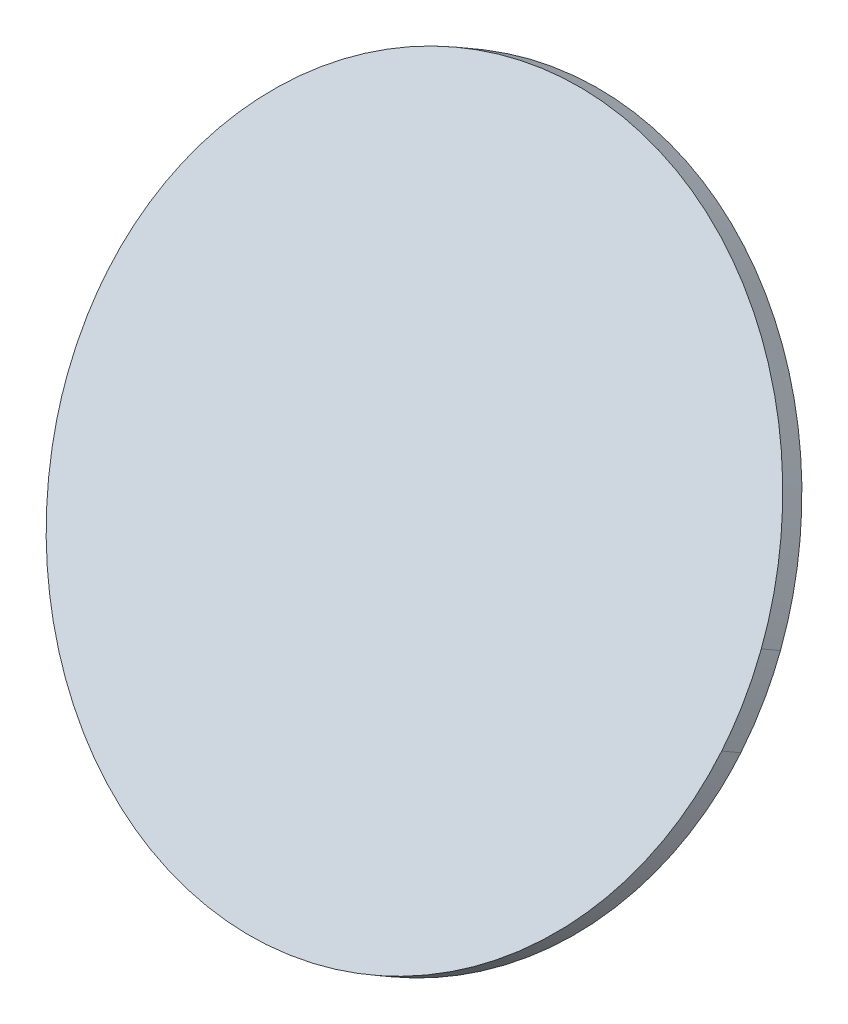
ISO-10303-21;
HEADER;
FILE_DESCRIPTION(('STEP AP214'),'2;1');
FILE_NAME('part.step','',(''),(''),'','','');
FILE_SCHEMA(('AUTOMOTIVE_DESIGN { 1 0 10303 214 1 1 1 1 }'));
ENDSEC;
DATA;
#1=APPLICATION_CONTEXT('core data for automotive mechanical design processes');
#2=APPLICATION_PROTOCOL_DEFINITION('international standard','automotive_design',2000,#1);
#3=PRODUCT_CONTEXT('',#1,'mechanical');
#4=PRODUCT('Part','Part','',(#3));
#5=PRODUCT_RELATED_PRODUCT_CATEGORY('part','',(#4));
#6=PRODUCT_DEFINITION_FORMATION('','',#4);
#7=PRODUCT_DEFINITION_CONTEXT('part definition',#1,'design');
#8=PRODUCT_DEFINITION('design','',#6,#7);
#9=PRODUCT_DEFINITION_SHAPE('','',#8);
#10=(LENGTH_UNIT() NAMED_UNIT(*) SI_UNIT(.MILLI.,.METRE.));
#11=(NAMED_UNIT(*) PLANE_ANGLE_UNIT() SI_UNIT($,.RADIAN.));
#12=(NAMED_UNIT(*) SI_UNIT($,.STERADIAN.) SOLID_ANGLE_UNIT());
#13=UNCERTAINTY_MEASURE_WITH_UNIT(LENGTH_MEASURE(1.E-05),#10,'distance_accuracy_value','');
#14=(GEOMETRIC_REPRESENTATION_CONTEXT(3) GLOBAL_UNCERTAINTY_ASSIGNED_CONTEXT((#13)) GLOBAL_UNIT_ASSIGNED_CONTEXT((#10,
#11,#12)) REPRESENTATION_CONTEXT('',''));
#15=CARTESIAN_POINT('',(0.,0.,0.));
#16=DIRECTION('',(0.,0.,1.));
#17=DIRECTION('',(1.,0.,0.));
#18=AXIS2_PLACEMENT_3D('',#15,#16,#17);
#19=CARTESIAN_POINT('',(-13.6505402858314,-0.494472906039299,47.8675883449257));
#20=DIRECTION('',(-0.992732360160244,-0.104220179514352,0.0601715486976022));
#21=DIRECTION('',(0.104409363979591,-0.99453440599779,0.));
#22=AXIS2_PLACEMENT_3D('',#19,#20,#21);
#23=PLANE('',#22);
#24=CARTESIAN_POINT('',(-13.6505052414415,-0.0336611422371881,48.6663159080203));
#25=DIRECTION('',(0.,-0.5,-0.866025403784438));
#26=VECTOR('',#25,1.);
#27=LINE('',#24,#26);
#28=CARTESIAN_POINT('',(-13.6505213296175,-0.49460832937357,47.8676665316272));
#29=VERTEX_POINT('',#28);
#30=CARTESIAN_POINT('',(-13.6505213296175,-0.0335462082541173,48.6662495508516));
#31=VERTEX_POINT('',#30);
#32=EDGE_CURVE('E11',#29,#31,#27,.F.);
#33=ORIENTED_EDGE('',*,*,#32,.T.);
#34=CARTESIAN_POINT('',(-13.6505402653328,-0.494473052579629,47.8675884295308));
#35=DIRECTION('',(0.,0.5,0.866025403784438));
#36=VECTOR('',#35,1.);
#37=LINE('',#34,#36);
#38=EDGE_CURVE('E187',#29,#31,#37,.T.);
#39=ORIENTED_EDGE('',*,*,#38,.F.);
#40=EDGE_LOOP('',(#33,#39));
#41=FACE_BOUND('',#40,.T.);
#42=ADVANCED_FACE('F17',(#41),#23,.T.);
#43=CARTESIAN_POINT('',(-13.6505052414415,-0.49472326335912,47.8677328887916));
#44=CARTESIAN_POINT('',(-13.5495512488857,-1.21545715058712,48.2838487925968));
#45=CARTESIAN_POINT('',(-13.3745881324311,-1.91780275342263,48.689348215458));
#46=CARTESIAN_POINT('',(-13.0052275951959,-2.94475687501539,49.282260454005));
#47=CARTESIAN_POINT('',(-12.8641291803356,-3.28260804855727,49.4773189199954));
#48=CARTESIAN_POINT('',(-12.6251021611596,-3.78258213225529,49.7659790918063));
#49=CARTESIAN_POINT('',(-12.5408566745206,-3.94810601983008,49.8615443528549));
#50=CARTESIAN_POINT('',(-12.3630417023739,-4.276832058662,50.0513344198642));
#51=CARTESIAN_POINT('',(-12.2701438381123,-4.43879629905658,50.1448445176551));
#52=CARTESIAN_POINT('',(-11.7860899669327,-5.23685645243119,50.6056047620355));
#53=CARTESIAN_POINT('',(-11.3366998580567,-5.83794547245015,50.9526436695503));
#54=CARTESIAN_POINT('',(-10.5711903274623,-6.68462008782544,51.4414714866533));
#55=CARTESIAN_POINT('',(-10.3006992980288,-6.95763477010838,51.599096586962));
#56=CARTESIAN_POINT('',(-9.87120599552155,-7.35287563749289,51.8272890081412));
#57=CARTESIAN_POINT('',(-9.7238418527359,-7.48241588817263,51.9020791067421));
#58=CARTESIAN_POINT('',(-9.42413279850591,-7.73415449398672,52.0474204585743));
#59=CARTESIAN_POINT('',(-9.27146925044787,-7.85666414814868,52.118151440383));
#60=CARTESIAN_POINT('',(-8.49433926760533,-8.4526926833286,52.4622686756138));
#61=CARTESIAN_POINT('',(-7.82858436663462,-8.87682968132684,52.7071442855814));
#62=CARTESIAN_POINT('',(-6.94171550606255,-9.3416081865757,52.9754842807004));
#63=CARTESIAN_POINT('',(-6.76159620947471,-9.43128018200747,53.0272564314017));
#64=CARTESIAN_POINT('',(-6.39577511553534,-9.60394738331854,53.1269458865589));
#65=CARTESIAN_POINT('',(-6.20981208641367,-9.68705206751237,53.1749263983491));
#66=CARTESIAN_POINT('',(-5.64503516282385,-9.92535963035379,53.3125133339055));
#67=CARTESIAN_POINT('',(-5.26294599079098,-10.0680174678255,53.3948768747718));
#68=CARTESIAN_POINT('',(-4.10071084865124,-10.4495205676415,53.6151377921473));
#69=CARTESIAN_POINT('',(-3.30480234773283,-10.6424923038571,53.7265500759973));
#70=CARTESIAN_POINT('',(-2.28288358222841,-10.8050327155678,53.8203928264527));
#71=CARTESIAN_POINT('',(-2.07714788341881,-10.8336062446625,53.8368897611672));
#72=CARTESIAN_POINT('',(-1.66294202196277,-10.8827952217691,53.8652890303408));
#73=CARTESIAN_POINT('',(-1.45441733459374,-10.9033880280826,53.8771782926093));
#74=CARTESIAN_POINT('',(-0.831131178508721,-10.9525922030905,53.9055863362954));
#75=CARTESIAN_POINT('',(-0.416519749797412,-10.9689616674171,53.9150372509308));
#76=CARTESIAN_POINT('',(0.410893087938072,-10.9691100028353,53.9151228924244));
#77=CARTESIAN_POINT('',(0.823694381374378,-10.9528867926917,53.9057564176809));
#78=CARTESIAN_POINT('',(1.64751910174132,-10.8884287183186,53.8685415310902));
#79=CARTESIAN_POINT('',(2.05854274106034,-10.8401976782814,53.8406953271414));
#80=CARTESIAN_POINT('',(2.57117734497298,-10.7592933872919,53.79398521296));
#81=CARTESIAN_POINT('',(2.67364679270858,-10.7420776891374,53.7840457249962));
#82=CARTESIAN_POINT('',(2.8784689431106,-10.7055442211831,53.7629531174384));
#83=CARTESIAN_POINT('',(2.98094748847037,-10.6861985695821,53.7517839002789));
#84=CARTESIAN_POINT('',(3.28683408453654,-10.62524031285,53.7165896343453));
#85=CARTESIAN_POINT('',(3.4889255988897,-10.5806896195719,53.6908682795886));
#86=CARTESIAN_POINT('',(4.0898536695411,-10.4356267584786,53.607116197687));
#87=CARTESIAN_POINT('',(4.48336407552276,-10.3237471821038,53.5425224941501));
#88=CARTESIAN_POINT('',(5.64303420431041,-9.94358539047557,53.323035981418));
#89=CARTESIAN_POINT('',(6.38825554924665,-9.63061515823554,53.1423425335859));
#90=CARTESIAN_POINT('',(7.19423676343978,-9.20938887660696,52.8991474264979));
#91=CARTESIAN_POINT('',(7.2834190719511,-9.16157329431597,52.8715410871907));
#92=CARTESIAN_POINT('',(7.46000848892109,-9.06446966130741,52.8154782785339));
#93=CARTESIAN_POINT('',(7.72250263278259,-8.91646781329034,52.7300293717407));
#94=CARTESIAN_POINT('',(7.97789314322838,-8.76149187188829,52.6405539702543));
#95=CARTESIAN_POINT('',(8.47926870419283,-8.44230604470369,52.4562719470078));
#96=CARTESIAN_POINT('',(8.80100663036371,-8.2172312192198,52.3263249359268));
#97=CARTESIAN_POINT('',(9.41997493598187,-7.74302093484309,52.0525395005895));
#98=CARTESIAN_POINT('',(9.71720706023099,-7.49388718893436,51.9087020653248));
#99=CARTESIAN_POINT('',(10.1443621013055,-7.10183430815884,51.6823502290725));
#100=CARTESIAN_POINT('',(10.283615922458,-6.96807592164937,51.6051247886149));
#101=CARTESIAN_POINT('',(10.5557878041592,-6.69433892532616,51.4470826601005));
#102=CARTESIAN_POINT('',(10.6890331014699,-6.55398796915597,51.3660509977747));
#103=CARTESIAN_POINT('',(11.3343962716527,-5.84162667380783,50.9547690121451));
#104=CARTESIAN_POINT('',(11.7839232880446,-5.23934992873566,50.6070443712511));
#105=CARTESIAN_POINT('',(12.3613544633483,-4.28894728844883,50.0583291510429));
#106=CARTESIAN_POINT('',(12.5375888267686,-3.96426690053094,49.870874841678));
#107=CARTESIAN_POINT('',(12.7771341672726,-3.46521255927967,49.5827456834163));
#108=CARTESIAN_POINT('',(12.8528477633862,-3.29685525118747,49.4855445462692));
#109=CARTESIAN_POINT('',(12.9958149576621,-2.95603659808219,49.288772805154));
#110=CARTESIAN_POINT('',(13.0628272382702,-2.78411223184018,49.1895122260239));
#111=CARTESIAN_POINT('',(13.3741397520542,-1.9209742738273,48.6911792936174));
#112=CARTESIAN_POINT('',(13.5495531983658,-1.21544323279774,48.2838407571573));
#113=CARTESIAN_POINT('',(13.6505052414415,-0.494723263359676,47.8677328887919));
#114=B_SPLINE_CURVE_WITH_KNOTS('',3,(#43,#44,#45,#46,#47,#48,#49,#50,#51,#52,#53,#54,#55,#56,
#57,#58,#59,#60,#61,#62,#63,#64,#65,#66,#67,#68,#69,#70,#71,#72,#73,#74,#75,#76,#77,#78,#79,#80,
#81,#82,#83,#84,#85,#86,#87,#88,#89,#90,#91,#92,#93,#94,#95,#96,#97,#98,#99,#100,#101,#102,#103,
#104,#105,#106,#107,#108,#109,#110,#111,#112,#113),.UNSPECIFIED.,.F.,.F.,(4,2,2,2,2,2,2,2,2,2,2,
2,2,2,2,2,2,2,2,2,2,2,2,2,2,1,2,2,2,2,2,2,2,2,2,4),(0.,0.0625000000000013,0.0937500000000019,
0.109375000000002,0.125000000000002,0.187500000000002,0.218750000000002,0.234375000000002,
0.250000000000002,0.312500000000002,0.328125000000002,0.343750000000002,0.375000000000001,
0.437500000000001,0.453125000000001,0.468750000000001,0.5,0.53125,0.5625,0.5703125,0.578125,
0.59375,0.624999999999999,0.687499999999999,0.695312499999999,0.703124999999999,
0.718749999999999,0.749999999999999,0.78125,0.796875,0.8125,0.875,0.90625,0.921875,0.9375,1.),.UNSPECIFIED.);
#115=DIRECTION('',(0.,0.5,0.866025403784438));
#116=VECTOR('',#115,1.);
#117=SURFACE_OF_LINEAR_EXTRUSION('',#114,#116);
#118=CARTESIAN_POINT('',(13.6505052414415,-0.0336611422402176,48.6663159080163));
#119=CARTESIAN_POINT('',(13.5495531983658,-0.754381111678282,49.0824237763817));
#120=CARTESIAN_POINT('',(13.3741397520542,-1.45991215270784,49.4897623128418));
#121=CARTESIAN_POINT('',(13.0628272382702,-2.32305011072072,49.9880952452483));
#122=CARTESIAN_POINT('',(12.9958149576621,-2.49497447696273,50.0873558243784));
#123=CARTESIAN_POINT('',(12.8528477633862,-2.83579313006802,50.2841275654936));
#124=CARTESIAN_POINT('',(12.7771341672726,-3.00415043816021,50.3813287026407));
#125=CARTESIAN_POINT('',(12.5375888267686,-3.50320477941148,50.6694578609023));
#126=CARTESIAN_POINT('',(12.3613544633483,-3.82788516732937,50.8569121702673));
#127=CARTESIAN_POINT('',(11.7839232880446,-4.77828780761621,51.4056273904754));
#128=CARTESIAN_POINT('',(11.3343962716527,-5.38056455268837,51.7533520313695));
#129=CARTESIAN_POINT('',(10.6890331014699,-6.09292584803651,52.164634016999));
#130=CARTESIAN_POINT('',(10.5557878041592,-6.2332768042067,52.2456656793249));
#131=CARTESIAN_POINT('',(10.283615922458,-6.50701380052991,52.4037078078393));
#132=CARTESIAN_POINT('',(10.1443621013055,-6.64077218703939,52.4809332482969));
#133=CARTESIAN_POINT('',(9.71720706023099,-7.0328250678149,52.7072850845492));
#134=CARTESIAN_POINT('',(9.41997493598187,-7.28195881372363,52.8511225198138));
#135=CARTESIAN_POINT('',(8.80100663036371,-7.75616909810034,53.1249079551512));
#136=CARTESIAN_POINT('',(8.47926870419283,-7.98124392358423,53.2548549662321));
#137=CARTESIAN_POINT('',(7.97789314322838,-8.30042975076883,53.4391369894787));
#138=CARTESIAN_POINT('',(7.72250263278259,-8.45540569217088,53.5286123909651));
#139=CARTESIAN_POINT('',(7.46000848892109,-8.60340754018795,53.6140612977583));
#140=CARTESIAN_POINT('',(7.2834190719511,-8.70051117319651,53.6701241064151));
#141=CARTESIAN_POINT('',(7.19423676343978,-8.7483267554875,53.6977304457222));
#142=CARTESIAN_POINT('',(6.38825554924665,-9.16955303711608,53.9409255528102));
#143=CARTESIAN_POINT('',(5.64303420431041,-9.48252326935611,54.1216190006424));
#144=CARTESIAN_POINT('',(4.48336407552276,-9.86268506098429,54.3411055133745));
#145=CARTESIAN_POINT('',(4.0898536695411,-9.97456463735912,54.4056992169113));
#146=CARTESIAN_POINT('',(3.4889255988897,-10.1196274984524,54.489451298813));
#147=CARTESIAN_POINT('',(3.28683408453654,-10.1641781917305,54.5151726535697));
#148=CARTESIAN_POINT('',(2.98094748847037,-10.2251364484626,54.5503669195033));
#149=CARTESIAN_POINT('',(2.8784689431106,-10.2444821000637,54.5615361366628));
#150=CARTESIAN_POINT('',(2.67364679270858,-10.2810155680179,54.5826287442206));
#151=CARTESIAN_POINT('',(2.57117734497298,-10.2982312661725,54.5925682321844));
#152=CARTESIAN_POINT('',(2.05854274106034,-10.3791355571619,54.6392783463658));
#153=CARTESIAN_POINT('',(1.64751910174132,-10.4273665971991,54.6671245503146));
#154=CARTESIAN_POINT('',(0.823694381374378,-10.4918246715722,54.7043394369053));
#155=CARTESIAN_POINT('',(0.410893087938072,-10.5080478817158,54.7137059116488));
#156=CARTESIAN_POINT('',(-0.416519749797412,-10.5078995462976,54.7136202701552));
#157=CARTESIAN_POINT('',(-0.831131178508721,-10.491530081971,54.7041693555197));
#158=CARTESIAN_POINT('',(-1.45441733459374,-10.4423259069632,54.6757613118337));
#159=CARTESIAN_POINT('',(-1.66294202196277,-10.4217331006496,54.6638720495652));
#160=CARTESIAN_POINT('',(-2.07714788341881,-10.3725441235431,54.6354727803916));
#161=CARTESIAN_POINT('',(-2.28288358222841,-10.3439705944484,54.6189758456771));
#162=CARTESIAN_POINT('',(-3.30480234773283,-10.1814301827376,54.5251330952217));
#163=CARTESIAN_POINT('',(-4.10071084865124,-9.98845844652207,54.4137208113716));
#164=CARTESIAN_POINT('',(-5.26294599079098,-9.60695534670604,54.1934598939962));
#165=CARTESIAN_POINT('',(-5.64503516282385,-9.46429750923433,54.1110963531299));
#166=CARTESIAN_POINT('',(-6.20981208641367,-9.22598994639291,53.9735094175735));
#167=CARTESIAN_POINT('',(-6.39577511553534,-9.14288526219908,53.9255289057832));
#168=CARTESIAN_POINT('',(-6.76159620947471,-8.97021806088801,53.825839450626));
#169=CARTESIAN_POINT('',(-6.94171550606255,-8.88054606545624,53.7740672999247));
#170=CARTESIAN_POINT('',(-7.82858436663462,-8.41576756020739,53.5057273048058));
#171=CARTESIAN_POINT('',(-8.49433926760533,-7.99163056220914,53.2608516948382));
#172=CARTESIAN_POINT('',(-9.27146925044787,-7.39560202702922,52.9167344596074));
#173=CARTESIAN_POINT('',(-9.42413279850591,-7.27309237286726,52.8460034777986));
#174=CARTESIAN_POINT('',(-9.7238418527359,-7.02135376705317,52.7006621259665));
#175=CARTESIAN_POINT('',(-9.87120599552155,-6.89181351637343,52.6258720273656));
#176=CARTESIAN_POINT('',(-10.3006992980288,-6.49657264898893,52.3976796061864));
#177=CARTESIAN_POINT('',(-10.5711903274623,-6.22355796670599,52.2400545058777));
#178=CARTESIAN_POINT('',(-11.3366998580567,-5.37688335133069,51.7512266887747));
#179=CARTESIAN_POINT('',(-11.7860899669327,-4.77579433131173,51.4041877812598));
#180=CARTESIAN_POINT('',(-12.2701438381123,-3.97773417793712,50.9434275368795));
#181=CARTESIAN_POINT('',(-12.3630417023739,-3.81576993754254,50.8499174390886));
#182=CARTESIAN_POINT('',(-12.5408566745206,-3.48704389871062,50.6601273720793));
#183=CARTESIAN_POINT('',(-12.6251021611596,-3.32152001113583,50.5645621110307));
#184=CARTESIAN_POINT('',(-12.8641291803356,-2.82154592743781,50.2759019392198));
#185=CARTESIAN_POINT('',(-13.0052275951959,-2.48369475389593,50.0808434732294));
#186=CARTESIAN_POINT('',(-13.3745881324311,-1.45674063230317,49.4879312346824));
#187=CARTESIAN_POINT('',(-13.5495512488857,-0.754395029467658,49.0824318118212));
#188=CARTESIAN_POINT('',(-13.6505052414415,-0.0336611422396619,48.666315908016));
#189=B_SPLINE_CURVE_WITH_KNOTS('',3,(#118,#119,#120,#121,#122,#123,#124,#125,#126,#127,#128,
#129,#130,#131,#132,#133,#134,#135,#136,#137,#138,#139,#140,#141,#142,#143,#144,#145,#146,#147,
#148,#149,#150,#151,#152,#153,#154,#155,#156,#157,#158,#159,#160,#161,#162,#163,#164,#165,#166,
#167,#168,#169,#170,#171,#172,#173,#174,#175,#176,#177,#178,#179,#180,#181,#182,#183,#184,#185,
#186,#187,#188),.UNSPECIFIED.,.F.,.F.,(4,2,2,2,2,2,2,2,2,2,1,2,2,2,2,2,2,2,2,2,2,2,2,2,2,2,2,2,
2,2,2,2,2,2,2,4),(0.,0.0624999999999997,0.0781249999999997,0.0937499999999997,0.125,0.1875,
0.203125,0.21875,0.250000000000001,0.281250000000001,0.296875000000001,0.304687500000001,
0.312500000000001,0.375000000000001,0.40625,0.421875,0.4296875,0.4375,0.46875,0.5,
0.531249999999999,0.546874999999999,0.562499999999999,0.624999999999999,0.656249999999998,
0.671874999999998,0.687499999999998,0.749999999999998,0.765624999999998,0.781249999999998,
0.812499999999998,0.874999999999998,0.890624999999998,0.906249999999998,0.937499999999999,1.),.UNSPECIFIED.);
#190=CARTESIAN_POINT('',(13.6505402653328,-0.033410931460125,48.6661714487551));
#191=VERTEX_POINT('',#190);
#192=EDGE_CURVE('E214',#31,#191,#189,.F.);
#193=ORIENTED_EDGE('',*,*,#192,.F.);
#194=ORIENTED_EDGE('',*,*,#32,.F.);
#195=CARTESIAN_POINT('',(-13.6505052414415,-0.494723263356643,47.8677328887959));
#196=CARTESIAN_POINT('',(-13.5495512488857,-1.21545715058464,48.2838487926011));
#197=CARTESIAN_POINT('',(-13.3745881324311,-1.91780275342015,48.6893482154623));
#198=CARTESIAN_POINT('',(-13.0052275951959,-2.94475687501292,49.2822604540093));
#199=CARTESIAN_POINT('',(-12.8641291803356,-3.28260804855479,49.4773189199997));
#200=CARTESIAN_POINT('',(-12.6251021611596,-3.78258213225281,49.7659790918106));
#201=CARTESIAN_POINT('',(-12.5408566745206,-3.9481060198276,49.8615443528592));
#202=CARTESIAN_POINT('',(-12.3630417023739,-4.27683205865952,50.0513344198685));
#203=CARTESIAN_POINT('',(-12.2701438381123,-4.4387962990541,50.1448445176594));
#204=CARTESIAN_POINT('',(-11.7860899669327,-5.23685645242872,50.6056047620398));
#205=CARTESIAN_POINT('',(-11.3366998580567,-5.83794547244767,50.9526436695546));
#206=CARTESIAN_POINT('',(-10.5711903274623,-6.68462008782297,51.4414714866576));
#207=CARTESIAN_POINT('',(-10.3006992980288,-6.95763477010591,51.5990965869663));
#208=CARTESIAN_POINT('',(-9.87120599552155,-7.35287563749041,51.8272890081455));
#209=CARTESIAN_POINT('',(-9.7238418527359,-7.48241588817015,51.9020791067464));
#210=CARTESIAN_POINT('',(-9.42413279850591,-7.73415449398424,52.0474204585786));
#211=CARTESIAN_POINT('',(-9.27146925044787,-7.8566641481462,52.1181514403873));
#212=CARTESIAN_POINT('',(-8.49433926760533,-8.45269268332612,52.4622686756181));
#213=CARTESIAN_POINT('',(-7.82858436663462,-8.87682968132437,52.7071442855857));
#214=CARTESIAN_POINT('',(-6.94171550606255,-9.34160818657323,52.9754842807047));
#215=CARTESIAN_POINT('',(-6.76159620947471,-9.431280182005,53.027256431406));
#216=CARTESIAN_POINT('',(-6.39577511553534,-9.60394738331606,53.1269458865631));
#217=CARTESIAN_POINT('',(-6.20981208641367,-9.6870520675099,53.1749263983534));
#218=CARTESIAN_POINT('',(-5.64503516282385,-9.92535963035132,53.3125133339098));
#219=CARTESIAN_POINT('',(-5.26294599079098,-10.068017467823,53.3948768747761));
#220=CARTESIAN_POINT('',(-4.10071084865124,-10.449520567639,53.6151377921515));
#221=CARTESIAN_POINT('',(-3.30480234773283,-10.6424923038546,53.7265500760016));
#222=CARTESIAN_POINT('',(-2.28288358222841,-10.8050327155654,53.820392826457));
#223=CARTESIAN_POINT('',(-2.07714788341881,-10.83360624466,53.8368897611715));
#224=CARTESIAN_POINT('',(-1.66294202196277,-10.8827952217666,53.8652890303451));
#225=CARTESIAN_POINT('',(-1.45441733459374,-10.9033880280801,53.8771782926136));
#226=CARTESIAN_POINT('',(-0.831131178508721,-10.952592203088,53.9055863362996));
#227=CARTESIAN_POINT('',(-0.416519749797412,-10.9689616674146,53.9150372509351));
#228=CARTESIAN_POINT('',(0.410893087938072,-10.9691100028328,53.9151228924287));
#229=CARTESIAN_POINT('',(0.823694381374378,-10.9528867926892,53.9057564176852));
#230=CARTESIAN_POINT('',(1.64751910174132,-10.8884287183161,53.8685415310945));
#231=CARTESIAN_POINT('',(2.05854274106034,-10.8401976782789,53.8406953271457));
#232=CARTESIAN_POINT('',(2.57117734497298,-10.7592933872895,53.7939852129643));
#233=CARTESIAN_POINT('',(2.67364679270858,-10.7420776891349,53.7840457250005));
#234=CARTESIAN_POINT('',(2.8784689431106,-10.7055442211807,53.7629531174427));
#235=CARTESIAN_POINT('',(2.98094748847037,-10.6861985695796,53.7517839002832));
#236=CARTESIAN_POINT('',(3.28683408453654,-10.6252403128475,53.7165896343496));
#237=CARTESIAN_POINT('',(3.4889255988897,-10.5806896195694,53.6908682795929));
#238=CARTESIAN_POINT('',(4.0898536695411,-10.4356267584761,53.6071161976912));
#239=CARTESIAN_POINT('',(4.48336407552276,-10.3237471821013,53.5425224941544));
#240=CARTESIAN_POINT('',(5.64303420431041,-9.94358539047309,53.3230359814223));
#241=CARTESIAN_POINT('',(6.38825554924665,-9.63061515823306,53.1423425335902));
#242=CARTESIAN_POINT('',(7.19423676343978,-9.20938887660448,52.8991474265021));
#243=CARTESIAN_POINT('',(7.2834190719511,-9.16157329431349,52.871541087195));
#244=CARTESIAN_POINT('',(7.46000848892109,-9.06446966130494,52.8154782785382));
#245=CARTESIAN_POINT('',(7.72250263278259,-8.91646781328786,52.730029371745));
#246=CARTESIAN_POINT('',(7.97789314322838,-8.76149187188581,52.6405539702586));
#247=CARTESIAN_POINT('',(8.47926870419283,-8.44230604470121,52.456271947012));
#248=CARTESIAN_POINT('',(8.80100663036371,-8.21723121921732,52.3263249359311));
#249=CARTESIAN_POINT('',(9.41997493598187,-7.74302093484061,52.0525395005938));
#250=CARTESIAN_POINT('',(9.71720706023099,-7.49388718893188,51.9087020653291));
#251=CARTESIAN_POINT('',(10.1443621013055,-7.10183430815637,51.6823502290768));
#252=CARTESIAN_POINT('',(10.283615922458,-6.9680759216469,51.6051247886192));
#253=CARTESIAN_POINT('',(10.5557878041592,-6.69433892532369,51.4470826601048));
#254=CARTESIAN_POINT('',(10.6890331014699,-6.55398796915349,51.3660509977789));
#255=CARTESIAN_POINT('',(11.3343962716527,-5.84162667380535,50.9547690121494));
#256=CARTESIAN_POINT('',(11.7839232880446,-5.23934992873319,50.6070443712553));
#257=CARTESIAN_POINT('',(12.3613544633483,-4.28894728844635,50.0583291510472));
#258=CARTESIAN_POINT('',(12.5375888267686,-3.96426690052846,49.8708748416822));
#259=CARTESIAN_POINT('',(12.7771341672726,-3.46521255927719,49.5827456834206));
#260=CARTESIAN_POINT('',(12.8528477633862,-3.296855251185,49.4855445462735));
#261=CARTESIAN_POINT('',(12.9958149576621,-2.95603659807971,49.2887728051583));
#262=CARTESIAN_POINT('',(13.0628272382702,-2.78411223183771,49.1895122260282));
#263=CARTESIAN_POINT('',(13.3741397520542,-1.92097427382482,48.6911792936217));
#264=CARTESIAN_POINT('',(13.5495531983658,-1.21544323279526,48.2838407571616));
#265=CARTESIAN_POINT('',(13.6505052414415,-0.494723263357199,47.8677328887962));
#266=B_SPLINE_CURVE_WITH_KNOTS('',3,(#195,#196,#197,#198,#199,#200,#201,#202,#203,#204,#205,
#206,#207,#208,#209,#210,#211,#212,#213,#214,#215,#216,#217,#218,#219,#220,#221,#222,#223,#224,
#225,#226,#227,#228,#229,#230,#231,#232,#233,#234,#235,#236,#237,#238,#239,#240,#241,#242,#243,
#244,#245,#246,#247,#248,#249,#250,#251,#252,#253,#254,#255,#256,#257,#258,#259,#260,#261,#262,
#263,#264,#265),.UNSPECIFIED.,.F.,.F.,(4,2,2,2,2,2,2,2,2,2,2,2,2,2,2,2,2,2,2,2,2,2,2,2,2,1,2,2,
2,2,2,2,2,2,2,4),(0.,0.0625000000000013,0.0937500000000019,0.109375000000002,0.125000000000002,
0.187500000000002,0.218750000000002,0.234375000000002,0.250000000000002,0.312500000000002,
0.328125000000002,0.343750000000002,0.375000000000001,0.437500000000001,0.453125000000001,
0.468750000000001,0.5,0.53125,0.5625,0.5703125,0.578125,0.59375,0.624999999999999,
0.687499999999999,0.695312499999999,0.703124999999999,0.718749999999999,0.749999999999999,
0.78125,0.796875,0.8125,0.875,0.90625,0.921875,0.9375,1.),.UNSPECIFIED.);
#267=CARTESIAN_POINT('',(13.6505402653328,-0.494473052579578,47.8675884295307));
#268=VERTEX_POINT('',#267);
#269=EDGE_CURVE('E36',#29,#268,#266,.T.);
#270=ORIENTED_EDGE('',*,*,#269,.T.);
#271=CARTESIAN_POINT('',(13.6505052414415,-0.494723263359672,47.867732888792));
#272=DIRECTION('',(0.,0.5,0.866025403784438));
#273=VECTOR('',#272,1.);
#274=LINE('',#271,#273);
#275=EDGE_CURVE('E28',#268,#191,#274,.T.);
#276=ORIENTED_EDGE('',*,*,#275,.T.);
#277=EDGE_LOOP('',(#193,#194,#270,#276));
#278=FACE_BOUND('',#277,.T.);
#279=ADVANCED_FACE('F216',(#278),#117,.T.);
#280=CARTESIAN_POINT('',(13.6505402653328,-0.494473052579583,47.8675884295307));
#281=CARTESIAN_POINT('',(13.7836253527789,0.456922998253207,47.3182996634765));
#282=CARTESIAN_POINT('',(13.7835817368386,1.42009304085734,46.7622131801035));
#283=CARTESIAN_POINT('',(13.6503906364872,2.37146014665198,46.2129411254748));
#284=B_SPLINE_CURVE_WITH_KNOTS('',3,(#280,#281,#282,#283),.UNSPECIFIED.,.F.,.F.,(4,4),(0.,1.),.UNSPECIFIED.);
#285=DIRECTION('',(0.,0.5,0.866025403784438));
#286=VECTOR('',#285,1.);
#287=SURFACE_OF_LINEAR_EXTRUSION('',#284,#286);
#288=CARTESIAN_POINT('',(13.6503906364872,2.83252226777145,47.0115241446992));
#289=CARTESIAN_POINT('',(13.7835817368386,1.88115516197681,47.5607961993279));
#290=CARTESIAN_POINT('',(13.7836253527789,0.917985119372679,48.1168826827008));
#291=CARTESIAN_POINT('',(13.6505402653328,-0.0334109314601116,48.6661714487551));
#292=B_SPLINE_CURVE_WITH_KNOTS('',3,(#288,#289,#290,#291),.UNSPECIFIED.,.F.,.F.,(4,4),(0.,1.),.UNSPECIFIED.);
#293=CARTESIAN_POINT('',(13.6503906364872,2.83252226777145,47.0115241446992));
#294=VERTEX_POINT('',#293);
#295=EDGE_CURVE('E219',#191,#294,#292,.F.);
#296=ORIENTED_EDGE('',*,*,#295,.F.);
#297=ORIENTED_EDGE('',*,*,#275,.F.);
#298=CARTESIAN_POINT('',(13.6505402653328,-0.494473052579573,47.8675884295307));
#299=CARTESIAN_POINT('',(13.7836253527789,0.456922998253218,47.3182996634765));
#300=CARTESIAN_POINT('',(13.7835817368386,1.42009304085735,46.7622131801036));
#301=CARTESIAN_POINT('',(13.6503906364872,2.37146014665199,46.2129411254749));
#302=B_SPLINE_CURVE_WITH_KNOTS('',3,(#298,#299,#300,#301),.UNSPECIFIED.,.F.,.F.,(4,4),(0.,1.),.UNSPECIFIED.);
#303=CARTESIAN_POINT('',(13.6503906364872,2.371460146652,46.2129411254749));
#304=VERTEX_POINT('',#303);
#305=EDGE_CURVE('E67',#268,#304,#302,.T.);
#306=ORIENTED_EDGE('',*,*,#305,.T.);
#307=CARTESIAN_POINT('',(13.6503906364872,2.37146014665199,46.2129411254749));
#308=DIRECTION('',(0.,0.5,0.866025403784439));
#309=VECTOR('',#308,1.);
#310=LINE('',#307,#309);
#311=EDGE_CURVE('E55',#304,#294,#310,.T.);
#312=ORIENTED_EDGE('',*,*,#311,.T.);
#313=EDGE_LOOP('',(#296,#297,#306,#312));
#314=FACE_BOUND('',#313,.T.);
#315=ADVANCED_FACE('F81',(#314),#287,.T.);
#316=CARTESIAN_POINT('',(13.6503906364872,2.371460146652,46.2129411254749));
#317=CARTESIAN_POINT('',(13.5003335898862,3.44303849358005,45.5942650784182));
#318=CARTESIAN_POINT('',(13.1301919762406,4.4739476670165,44.9990693896246));
#319=CARTESIAN_POINT('',(12.7609281228886,5.50241212441618,44.4052851582929));
#320=CARTESIAN_POINT('',(12.1842203707685,6.45723852696397,43.8540158777526));
#321=CARTESIAN_POINT('',(11.6045004679285,7.41705199796237,43.2998673118998));
#322=CARTESIAN_POINT('',(10.8338784988067,8.27096751292448,42.8068589594713));
#323=CARTESIAN_POINT('',(10.0649047646425,9.12305664159219,42.3149050716614));
#324=CARTESIAN_POINT('',(9.13015914694725,9.84196583253139,41.8998426567498));
#325=CARTESIAN_POINT('',(8.19673110239287,10.5598616831321,41.4853652941554));
#326=CARTESIAN_POINT('',(7.12826524504724,11.1208012616026,41.1615066775263));
#327=CARTESIAN_POINT('',(6.05712380104635,11.6831455105549,40.8368370740165));
#328=CARTESIAN_POINT('',(4.88832967153952,12.0679551655807,40.6146671161005));
#329=CARTESIAN_POINT('',(3.71955625891037,12.4527579998548,40.3925010961475));
#330=CARTESIAN_POINT('',(2.49645042537704,12.6480453401041,40.2797518976852));
#331=CARTESIAN_POINT('',(1.26220087551006,12.8451119431643,40.1659754413601));
#332=CARTESIAN_POINT('',(0.0113751135776118,12.8460185472709,40.1654520132351));
#333=CARTESIAN_POINT('',(-1.23195099346279,12.8469197155941,40.1649317234611));
#334=CARTESIAN_POINT('',(-2.45985291713191,12.6538442955339,40.2764038692067));
#335=CARTESIAN_POINT('',(-3.69002321113818,12.4604121966974,40.38808194354));
#336=CARTESIAN_POINT('',(-4.865612964613,12.0754145263813,40.6103604521343));
#337=CARTESIAN_POINT('',(-6.02968333825743,11.6941893748246,40.8304608960074));
#338=CARTESIAN_POINT('',(-7.09724296276161,11.1370396247793,41.152131454175));
#339=CARTESIAN_POINT('',(-8.17148251815777,10.5764036789831,41.4758147683979));
#340=CARTESIAN_POINT('',(-9.10993324539572,9.85749079979639,41.8908793127202));
#341=CARTESIAN_POINT('',(-10.0435448474866,9.14228499791407,42.3038035749629));
#342=CARTESIAN_POINT('',(-10.812648550664,8.29443158014058,42.7933119739478));
#343=CARTESIAN_POINT('',(-11.5868389934773,7.440970583613,43.2860579100358));
#344=CARTESIAN_POINT('',(-12.1698769741037,6.48092136428209,43.8403425852518));
#345=CARTESIAN_POINT('',(-12.7504467085178,5.52493643909305,44.3922807391509));
#346=CARTESIAN_POINT('',(-13.1227646591559,4.49456800076203,44.9871642343858));
#347=CARTESIAN_POINT('',(-13.4988178736052,3.45386243543129,45.5880158726767));
#348=CARTESIAN_POINT('',(-13.6503906364872,2.37146014665201,46.2129411254749));
#349=B_SPLINE_CURVE_WITH_KNOTS('',2,(#316,#317,#318,#319,#320,#321,#322,#323,#324,#325,#326,
#327,#328,#329,#330,#331,#332,#333,#334,#335,#336,#337,#338,#339,#340,#341,#342,#343,#344,#345,
#346,#347,#348),.UNSPECIFIED.,.F.,.F.,(3,2,2,2,2,2,2,2,2,2,2,2,2,2,2,2,3),(0.,0.0625,0.125,
0.1875,0.25,0.3125,0.375,0.4375,0.5,0.5625,0.625,0.6875,0.75,0.8125,0.875,0.9375,1.),.UNSPECIFIED.);
#350=DIRECTION('',(0.,0.5,0.866025403784438));
#351=VECTOR('',#350,1.);
#352=SURFACE_OF_LINEAR_EXTRUSION('',#349,#351);
#353=CARTESIAN_POINT('',(-13.6503906364872,2.83252226777146,47.0115241446992));
#354=CARTESIAN_POINT('',(-13.4988178736052,3.91492455655074,46.3865988919011));
#355=CARTESIAN_POINT('',(-13.1227646591559,4.95563012188149,45.7857472536102));
#356=CARTESIAN_POINT('',(-12.7504467085178,5.98599856021251,45.1908637583753));
#357=CARTESIAN_POINT('',(-12.1698769741037,6.94198348540154,44.6389256044762));
#358=CARTESIAN_POINT('',(-11.5868389934773,7.90203270473246,44.0846409292602));
#359=CARTESIAN_POINT('',(-10.812648550664,8.75549370126004,43.5918949931721));
#360=CARTESIAN_POINT('',(-10.0435448474866,9.60334711903352,43.1023865941873));
#361=CARTESIAN_POINT('',(-9.10993324539572,10.3185529209158,42.6894623319445));
#362=CARTESIAN_POINT('',(-8.17148251815777,11.0374658001025,42.2743977876222));
#363=CARTESIAN_POINT('',(-7.09724296276161,11.5981017458987,41.9507144733994));
#364=CARTESIAN_POINT('',(-6.02968333825743,12.155251495944,41.6290439152318));
#365=CARTESIAN_POINT('',(-4.865612964613,12.5364766475008,41.4089434713587));
#366=CARTESIAN_POINT('',(-3.69002321113818,12.9214743178168,41.1866649627643));
#367=CARTESIAN_POINT('',(-2.45985291713191,13.1149064166534,41.0749868884311));
#368=CARTESIAN_POINT('',(-1.23195099346279,13.3079818367136,40.9635147426855));
#369=CARTESIAN_POINT('',(0.0113751135776118,13.3070806683903,40.9640350324595));
#370=CARTESIAN_POINT('',(1.26220087551006,13.3061740642837,40.9645584605845));
#371=CARTESIAN_POINT('',(2.49645042537704,13.1091074612236,41.0783349169095));
#372=CARTESIAN_POINT('',(3.71955625891037,12.9138201209742,41.1910841153718));
#373=CARTESIAN_POINT('',(4.88832967153952,12.5290172867001,41.4132501353249));
#374=CARTESIAN_POINT('',(6.05712380104635,12.1442076316743,41.6354200932408));
#375=CARTESIAN_POINT('',(7.12826524504724,11.581863382722,41.9600896967507));
#376=CARTESIAN_POINT('',(8.19673110239287,11.0209238042515,42.2839483133797));
#377=CARTESIAN_POINT('',(9.13015914694725,10.3030279536508,42.6984256759741));
#378=CARTESIAN_POINT('',(10.0649047646425,9.58411876271165,43.1134880908858));
#379=CARTESIAN_POINT('',(10.8338784988067,8.73202963404394,43.6054419786956));
#380=CARTESIAN_POINT('',(11.6045004679285,7.87811411908183,44.0984503311242));
#381=CARTESIAN_POINT('',(12.1842203707685,6.91830064808343,44.652598896977));
#382=CARTESIAN_POINT('',(12.7609281228886,5.96347424553563,45.2038681775173));
#383=CARTESIAN_POINT('',(13.1301919762406,4.93500978813595,45.797652408849));
#384=CARTESIAN_POINT('',(13.5003335898862,3.90410061469951,46.3928480976426));
#385=CARTESIAN_POINT('',(13.6503906364872,2.83252226777145,47.0115241446992));
#386=B_SPLINE_CURVE_WITH_KNOTS('',2,(#353,#354,#355,#356,#357,#358,#359,#360,#361,#362,#363,
#364,#365,#366,#367,#368,#369,#370,#371,#372,#373,#374,#375,#376,#377,#378,#379,#380,#381,#382,
#383,#384,#385),.UNSPECIFIED.,.F.,.F.,(3,2,2,2,2,2,2,2,2,2,2,2,2,2,2,2,3),(0.,0.0625,0.125,
0.1875,0.25,0.3125,0.375,0.4375,0.5,0.5625,0.625,0.6875,0.75,0.8125,0.875,0.9375,1.),.UNSPECIFIED.);
#387=CARTESIAN_POINT('',(-13.6503906364872,2.83252226777146,47.0115241446992));
#388=VERTEX_POINT('',#387);
#389=EDGE_CURVE('E75',#294,#388,#386,.F.);
#390=ORIENTED_EDGE('',*,*,#389,.F.);
#391=ORIENTED_EDGE('',*,*,#311,.F.);
#392=CARTESIAN_POINT('',(13.6503906364872,2.371460146652,46.2129411254749));
#393=CARTESIAN_POINT('',(13.5003335898862,3.44303849358005,45.5942650784182));
#394=CARTESIAN_POINT('',(13.1301919762406,4.4739476670165,44.9990693896246));
#395=CARTESIAN_POINT('',(12.7609281228886,5.50241212441618,44.4052851582929));
#396=CARTESIAN_POINT('',(12.1842203707685,6.45723852696397,43.8540158777526));
#397=CARTESIAN_POINT('',(11.6045004679285,7.41705199796237,43.2998673118998));
#398=CARTESIAN_POINT('',(10.8338784988067,8.27096751292448,42.8068589594713));
#399=CARTESIAN_POINT('',(10.0649047646425,9.12305664159219,42.3149050716614));
#400=CARTESIAN_POINT('',(9.13015914694725,9.84196583253139,41.8998426567498));
#401=CARTESIAN_POINT('',(8.19673110239287,10.5598616831321,41.4853652941554));
#402=CARTESIAN_POINT('',(7.12826524504724,11.1208012616026,41.1615066775263));
#403=CARTESIAN_POINT('',(6.05712380104635,11.6831455105549,40.8368370740165));
#404=CARTESIAN_POINT('',(4.88832967153952,12.0679551655807,40.6146671161005));
#405=CARTESIAN_POINT('',(3.71955625891037,12.4527579998548,40.3925010961475));
#406=CARTESIAN_POINT('',(2.49645042537704,12.6480453401041,40.2797518976852));
#407=CARTESIAN_POINT('',(1.26220087551006,12.8451119431643,40.1659754413601));
#408=CARTESIAN_POINT('',(0.0113751135776118,12.8460185472709,40.1654520132351));
#409=CARTESIAN_POINT('',(-1.23195099346279,12.8469197155941,40.1649317234611));
#410=CARTESIAN_POINT('',(-2.45985291713191,12.6538442955339,40.2764038692067));
#411=CARTESIAN_POINT('',(-3.69002321113818,12.4604121966974,40.38808194354));
#412=CARTESIAN_POINT('',(-4.865612964613,12.0754145263813,40.6103604521343));
#413=CARTESIAN_POINT('',(-6.02968333825743,11.6941893748246,40.8304608960074));
#414=CARTESIAN_POINT('',(-7.09724296276161,11.1370396247793,41.152131454175));
#415=CARTESIAN_POINT('',(-8.17148251815777,10.5764036789831,41.4758147683979));
#416=CARTESIAN_POINT('',(-9.10993324539572,9.85749079979639,41.8908793127202));
#417=CARTESIAN_POINT('',(-10.0435448474866,9.14228499791407,42.3038035749629));
#418=CARTESIAN_POINT('',(-10.812648550664,8.29443158014058,42.7933119739478));
#419=CARTESIAN_POINT('',(-11.5868389934773,7.440970583613,43.2860579100358));
#420=CARTESIAN_POINT('',(-12.1698769741037,6.48092136428209,43.8403425852518));
#421=CARTESIAN_POINT('',(-12.7504467085178,5.52493643909305,44.3922807391509));
#422=CARTESIAN_POINT('',(-13.1227646591559,4.49456800076203,44.9871642343858));
#423=CARTESIAN_POINT('',(-13.4988178736052,3.45386243543129,45.5880158726767));
#424=CARTESIAN_POINT('',(-13.6503906364872,2.37146014665201,46.2129411254749));
#425=B_SPLINE_CURVE_WITH_KNOTS('',2,(#392,#393,#394,#395,#396,#397,#398,#399,#400,#401,#402,
#403,#404,#405,#406,#407,#408,#409,#410,#411,#412,#413,#414,#415,#416,#417,#418,#419,#420,#421,
#422,#423,#424),.UNSPECIFIED.,.F.,.F.,(3,2,2,2,2,2,2,2,2,2,2,2,2,2,2,2,3),(0.,0.0625,0.125,
0.1875,0.25,0.3125,0.375,0.4375,0.5,0.5625,0.625,0.6875,0.75,0.8125,0.875,0.9375,1.),.UNSPECIFIED.);
#426=CARTESIAN_POINT('',(-13.6503906364872,2.37146014665201,46.2129411254749));
#427=VERTEX_POINT('',#426);
#428=EDGE_CURVE('E72',#304,#427,#425,.T.);
#429=ORIENTED_EDGE('',*,*,#428,.T.);
#430=CARTESIAN_POINT('',(-13.6503906364872,2.37146014665201,46.2129411254749));
#431=DIRECTION('',(0.,0.5,0.866025403784439));
#432=VECTOR('',#431,1.);
#433=LINE('',#430,#432);
#434=EDGE_CURVE('E62',#427,#388,#433,.T.);
#435=ORIENTED_EDGE('',*,*,#434,.T.);
#436=EDGE_LOOP('',(#390,#391,#429,#435));
#437=FACE_BOUND('',#436,.T.);
#438=ADVANCED_FACE('F71',(#437),#352,.T.);
#439=CARTESIAN_POINT('',(-13.6503906364872,2.371460146652,46.2129411254749));
#440=CARTESIAN_POINT('',(-13.716987478441,1.89576736674761,46.4875824800042));
#441=CARTESIAN_POINT('',(-13.7499507988667,1.41827367515847,46.7632635913796));
#442=CARTESIAN_POINT('',(-13.7500561572337,0.459969168470871,47.3165409562813));
#443=CARTESIAN_POINT('',(-13.7170815573025,-0.0187839756725863,47.5929492129279));
#444=CARTESIAN_POINT('',(-13.6505402653328,-0.494473052579626,47.8675884295308));
#445=B_SPLINE_CURVE_WITH_KNOTS('',3,(#439,#440,#441,#442,#443,#444),.UNSPECIFIED.,.F.,.F.,(4,2,
4),(0.,0.5,1.),.UNSPECIFIED.);
#446=DIRECTION('',(0.,0.5,0.866025403784438));
#447=VECTOR('',#446,1.);
#448=SURFACE_OF_LINEAR_EXTRUSION('',#445,#447);
#449=CARTESIAN_POINT('',(-13.6505402653328,-0.0334109314601739,48.6661714487551));
#450=CARTESIAN_POINT('',(-13.7170815573025,0.442278145446866,48.3915322321523));
#451=CARTESIAN_POINT('',(-13.7500561572337,0.921031289590323,48.1151239755056));
#452=CARTESIAN_POINT('',(-13.7499507988667,1.87933579627792,47.5618466106039));
#453=CARTESIAN_POINT('',(-13.716987478441,2.35682948786706,47.2861654992286));
#454=CARTESIAN_POINT('',(-13.6503906364872,2.83252226777145,47.0115241446992));
#455=B_SPLINE_CURVE_WITH_KNOTS('',3,(#449,#450,#451,#452,#453,#454),.UNSPECIFIED.,.F.,.F.,(4,2,
4),(0.,0.5,1.),.UNSPECIFIED.);
#456=EDGE_CURVE('E174',#388,#31,#455,.F.);
#457=ORIENTED_EDGE('',*,*,#456,.F.);
#458=ORIENTED_EDGE('',*,*,#434,.F.);
#459=CARTESIAN_POINT('',(-13.6503906364872,2.371460146652,46.2129411254749));
#460=CARTESIAN_POINT('',(-13.716987478441,1.89576736674761,46.4875824800042));
#461=CARTESIAN_POINT('',(-13.7499507988667,1.41827367515847,46.7632635913796));
#462=CARTESIAN_POINT('',(-13.7500561572337,0.459969168470871,47.3165409562813));
#463=CARTESIAN_POINT('',(-13.7170815573025,-0.0187839756725863,47.5929492129279));
#464=CARTESIAN_POINT('',(-13.6505402653328,-0.494473052579626,47.8675884295308));
#465=B_SPLINE_CURVE_WITH_KNOTS('',3,(#459,#460,#461,#462,#463,#464),.UNSPECIFIED.,.F.,.F.,(4,2,
4),(0.,0.5,1.),.UNSPECIFIED.);
#466=EDGE_CURVE('E89',#427,#29,#465,.T.);
#467=ORIENTED_EDGE('',*,*,#466,.T.);
#468=ORIENTED_EDGE('',*,*,#38,.T.);
#469=EDGE_LOOP('',(#457,#458,#467,#468));
#470=FACE_BOUND('',#469,.T.);
#471=ADVANCED_FACE('F106',(#470),#448,.T.);
#472=CARTESIAN_POINT('',(-13.7495895867941,0.969446799073534,47.0223939091068));
#473=DIRECTION('',(0.,0.5,0.866025403784438));
#474=DIRECTION('',(-1.,0.,0.));
#475=AXIS2_PLACEMENT_3D('',#472,#473,#474);
#476=PLANE('',#475);
#477=ORIENTED_EDGE('',*,*,#269,.F.);
#478=ORIENTED_EDGE('',*,*,#466,.F.);
#479=ORIENTED_EDGE('',*,*,#428,.F.);
#480=ORIENTED_EDGE('',*,*,#305,.F.);
#481=EDGE_LOOP('',(#477,#478,#479,#480));
#482=FACE_BOUND('',#481,.T.);
#483=ADVANCED_FACE('F87',(#482),#476,.F.);
#484=CARTESIAN_POINT('',(-13.7495895867941,1.43050892019299,47.8209769283311));
#485=DIRECTION('',(0.,0.5,0.866025403784438));
#486=DIRECTION('',(-1.,0.,0.));
#487=AXIS2_PLACEMENT_3D('',#484,#485,#486);
#488=PLANE('',#487);
#489=ORIENTED_EDGE('',*,*,#456,.T.);
#490=ORIENTED_EDGE('',*,*,#192,.T.);
#491=ORIENTED_EDGE('',*,*,#295,.T.);
#492=ORIENTED_EDGE('',*,*,#389,.T.);
#493=EDGE_LOOP('',(#489,#490,#491,#492));
#494=FACE_BOUND('',#493,.T.);
#495=ADVANCED_FACE('F105',(#494),#488,.T.);
#496=CLOSED_SHELL('',(#42,#279,#315,#438,#471,#483,#495));
#497=MANIFOLD_SOLID_BREP('B1',#496);
#498=ADVANCED_BREP_SHAPE_REPRESENTATION('',(#18,#497),#14);
#499=SHAPE_DEFINITION_REPRESENTATION(#9,#498);
ENDSEC;
END-ISO-10303-21;
